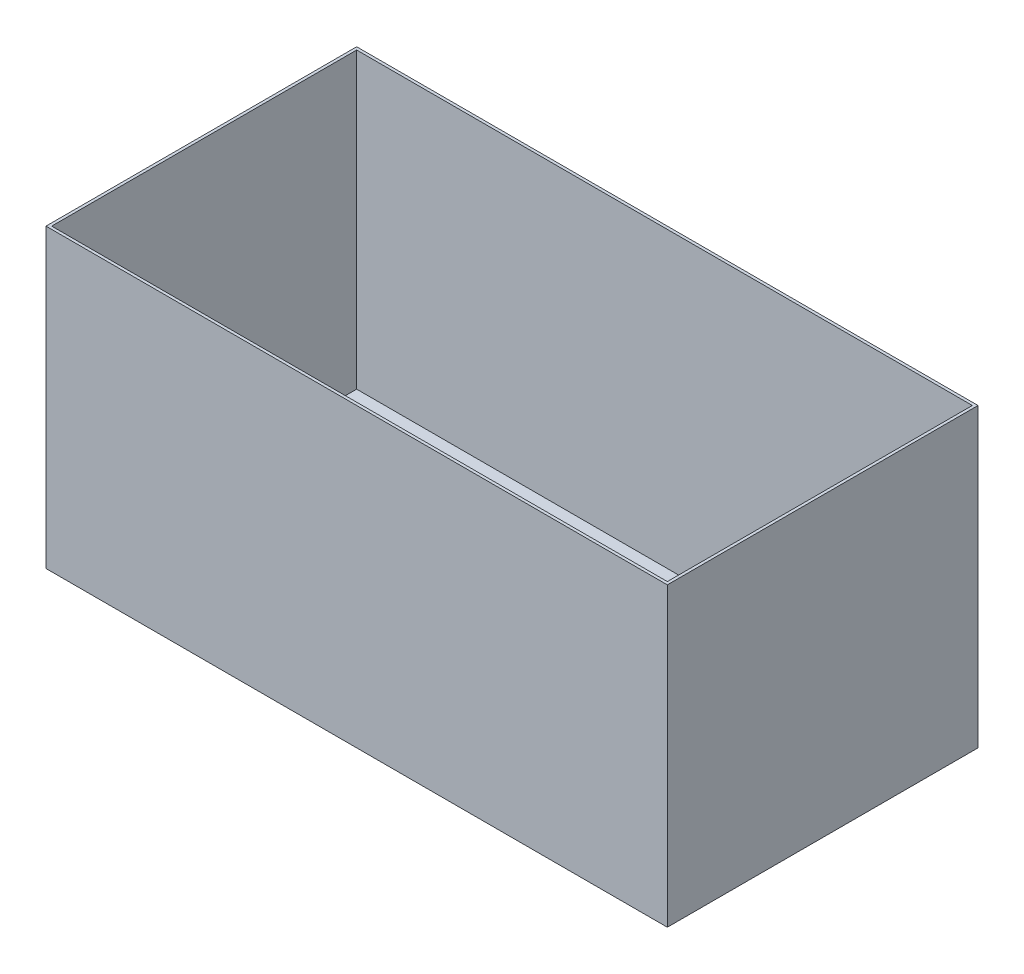
ISO-10303-21;
HEADER;
FILE_DESCRIPTION(('STEP AP214'),'2;1');
FILE_NAME('part.step','',(''),(''),'','','');
FILE_SCHEMA(('AUTOMOTIVE_DESIGN { 1 0 10303 214 1 1 1 1 }'));
ENDSEC;
DATA;
#1=APPLICATION_CONTEXT('core data for automotive mechanical design processes');
#2=APPLICATION_PROTOCOL_DEFINITION('international standard','automotive_design',2000,#1);
#3=PRODUCT_CONTEXT('',#1,'mechanical');
#4=PRODUCT('Part','Part','',(#3));
#5=PRODUCT_RELATED_PRODUCT_CATEGORY('part','',(#4));
#6=PRODUCT_DEFINITION_FORMATION('','',#4);
#7=PRODUCT_DEFINITION_CONTEXT('part definition',#1,'design');
#8=PRODUCT_DEFINITION('design','',#6,#7);
#9=PRODUCT_DEFINITION_SHAPE('','',#8);
#10=(LENGTH_UNIT() NAMED_UNIT(*) SI_UNIT(.MILLI.,.METRE.));
#11=(NAMED_UNIT(*) PLANE_ANGLE_UNIT() SI_UNIT($,.RADIAN.));
#12=(NAMED_UNIT(*) SI_UNIT($,.STERADIAN.) SOLID_ANGLE_UNIT());
#13=UNCERTAINTY_MEASURE_WITH_UNIT(LENGTH_MEASURE(1.E-05),#10,'distance_accuracy_value','');
#14=(GEOMETRIC_REPRESENTATION_CONTEXT(3) GLOBAL_UNCERTAINTY_ASSIGNED_CONTEXT((#13)) GLOBAL_UNIT_ASSIGNED_CONTEXT((#10,
#11,#12)) REPRESENTATION_CONTEXT('',''));
#15=CARTESIAN_POINT('',(0.,0.,0.));
#16=DIRECTION('',(0.,0.,1.));
#17=DIRECTION('',(1.,0.,0.));
#18=AXIS2_PLACEMENT_3D('',#15,#16,#17);
#19=CARTESIAN_POINT('',(0.,1050.,0.));
#20=DIRECTION('',(-1.,0.,0.));
#21=DIRECTION('',(0.,0.,1.));
#22=AXIS2_PLACEMENT_3D('',#19,#20,#21);
#23=PLANE('',#22);
#24=DIRECTION('',(0.,0.,-1.));
#25=VECTOR('',#24,1.);
#26=CARTESIAN_POINT('',(0.,0.,0.));
#27=LINE('',#26,#25);
#28=CARTESIAN_POINT('',(0.,0.,0.));
#29=VERTEX_POINT('',#28);
#30=CARTESIAN_POINT('',(0.,0.,-1100.));
#31=VERTEX_POINT('',#30);
#32=EDGE_CURVE('E153',#29,#31,#27,.T.);
#33=ORIENTED_EDGE('',*,*,#32,.T.);
#34=DIRECTION('',(0.,-1.,0.));
#35=VECTOR('',#34,1.);
#36=CARTESIAN_POINT('',(0.,1050.,-1100.));
#37=LINE('',#36,#35);
#38=CARTESIAN_POINT('',(0.,1050.,-1100.));
#39=VERTEX_POINT('',#38);
#40=EDGE_CURVE('E203',#39,#31,#37,.T.);
#41=ORIENTED_EDGE('',*,*,#40,.F.);
#42=DIRECTION('',(0.,0.,-1.));
#43=VECTOR('',#42,1.);
#44=CARTESIAN_POINT('',(0.,1050.,0.));
#45=LINE('',#44,#43);
#46=CARTESIAN_POINT('',(0.,1050.,0.));
#47=VERTEX_POINT('',#46);
#48=EDGE_CURVE('E185',#47,#39,#45,.T.);
#49=ORIENTED_EDGE('',*,*,#48,.F.);
#50=DIRECTION('',(0.,-1.,0.));
#51=VECTOR('',#50,1.);
#52=CARTESIAN_POINT('',(0.,1050.,0.));
#53=LINE('',#52,#51);
#54=EDGE_CURVE('E194',#47,#29,#53,.T.);
#55=ORIENTED_EDGE('',*,*,#54,.T.);
#56=EDGE_LOOP('',(#33,#41,#49,#55));
#57=FACE_BOUND('',#56,.T.);
#58=ADVANCED_FACE('F31',(#57),#23,.F.);
#59=CARTESIAN_POINT('',(0.,1050.,-1100.));
#60=DIRECTION('',(0.,0.,1.));
#61=DIRECTION('',(1.,0.,0.));
#62=AXIS2_PLACEMENT_3D('',#59,#60,#61);
#63=PLANE('',#62);
#64=DIRECTION('',(-1.,0.,0.));
#65=VECTOR('',#64,1.);
#66=CARTESIAN_POINT('',(0.,0.,-1100.));
#67=LINE('',#66,#65);
#68=CARTESIAN_POINT('',(-2200.,0.,-1100.));
#69=VERTEX_POINT('',#68);
#70=EDGE_CURVE('E179',#31,#69,#67,.T.);
#71=ORIENTED_EDGE('',*,*,#70,.T.);
#72=DIRECTION('',(0.,-1.,0.));
#73=VECTOR('',#72,1.);
#74=CARTESIAN_POINT('',(-2200.,1050.,-1100.));
#75=LINE('',#74,#73);
#76=CARTESIAN_POINT('',(-2200.,1050.,-1100.));
#77=VERTEX_POINT('',#76);
#78=EDGE_CURVE('E200',#77,#69,#75,.T.);
#79=ORIENTED_EDGE('',*,*,#78,.F.);
#80=DIRECTION('',(-1.,0.,0.));
#81=VECTOR('',#80,1.);
#82=CARTESIAN_POINT('',(0.,1050.,-1100.));
#83=LINE('',#82,#81);
#84=EDGE_CURVE('E188',#39,#77,#83,.T.);
#85=ORIENTED_EDGE('',*,*,#84,.F.);
#86=ORIENTED_EDGE('',*,*,#40,.T.);
#87=EDGE_LOOP('',(#71,#79,#85,#86));
#88=FACE_BOUND('',#87,.T.);
#89=ADVANCED_FACE('F229',(#88),#63,.F.);
#90=CARTESIAN_POINT('',(-2200.,1050.,2.69413397840923E-13));
#91=DIRECTION('',(1.,0.,0.));
#92=DIRECTION('',(0.,0.,-1.));
#93=AXIS2_PLACEMENT_3D('',#90,#91,#92);
#94=PLANE('',#93);
#95=DIRECTION('',(0.,0.,1.));
#96=VECTOR('',#95,1.);
#97=CARTESIAN_POINT('',(-2200.,0.,2.69413397840923E-13));
#98=LINE('',#97,#96);
#99=CARTESIAN_POINT('',(-2200.,0.,2.69413397840923E-13));
#100=VERTEX_POINT('',#99);
#101=EDGE_CURVE('E181',#69,#100,#98,.T.);
#102=ORIENTED_EDGE('',*,*,#101,.T.);
#103=DIRECTION('',(0.,-1.,0.));
#104=VECTOR('',#103,1.);
#105=CARTESIAN_POINT('',(-2200.,1050.,2.69413397840923E-13));
#106=LINE('',#105,#104);
#107=CARTESIAN_POINT('',(-2200.,1050.,2.69413397840923E-13));
#108=VERTEX_POINT('',#107);
#109=EDGE_CURVE('E197',#108,#100,#106,.T.);
#110=ORIENTED_EDGE('',*,*,#109,.F.);
#111=DIRECTION('',(0.,0.,1.));
#112=VECTOR('',#111,1.);
#113=CARTESIAN_POINT('',(-2200.,1050.,2.69413397840923E-13));
#114=LINE('',#113,#112);
#115=EDGE_CURVE('E190',#77,#108,#114,.T.);
#116=ORIENTED_EDGE('',*,*,#115,.F.);
#117=ORIENTED_EDGE('',*,*,#78,.T.);
#118=EDGE_LOOP('',(#102,#110,#116,#117));
#119=FACE_BOUND('',#118,.T.);
#120=ADVANCED_FACE('F234',(#119),#94,.F.);
#121=CARTESIAN_POINT('',(0.,1050.,0.));
#122=DIRECTION('',(0.,0.,-1.));
#123=DIRECTION('',(-1.,0.,0.));
#124=AXIS2_PLACEMENT_3D('',#121,#122,#123);
#125=PLANE('',#124);
#126=DIRECTION('',(1.,0.,0.));
#127=VECTOR('',#126,1.);
#128=CARTESIAN_POINT('',(0.,0.,0.));
#129=LINE('',#128,#127);
#130=EDGE_CURVE('E183',#100,#29,#129,.T.);
#131=ORIENTED_EDGE('',*,*,#130,.T.);
#132=ORIENTED_EDGE('',*,*,#54,.F.);
#133=DIRECTION('',(1.,0.,0.));
#134=VECTOR('',#133,1.);
#135=CARTESIAN_POINT('',(0.,1050.,0.));
#136=LINE('',#135,#134);
#137=EDGE_CURVE('E192',#108,#47,#136,.T.);
#138=ORIENTED_EDGE('',*,*,#137,.F.);
#139=ORIENTED_EDGE('',*,*,#109,.T.);
#140=EDGE_LOOP('',(#131,#132,#138,#139));
#141=FACE_BOUND('',#140,.T.);
#142=ADVANCED_FACE('F249',(#141),#125,.F.);
#143=CARTESIAN_POINT('',(0.,1050.,-1100.));
#144=DIRECTION('',(0.,1.,0.));
#145=DIRECTION('',(0.,0.,1.));
#146=AXIS2_PLACEMENT_3D('',#143,#144,#145);
#147=PLANE('',#146);
#148=DIRECTION('',(0.,0.,-1.));
#149=VECTOR('',#148,1.);
#150=CARTESIAN_POINT('',(-10.,1050.,0.));
#151=LINE('',#150,#149);
#152=CARTESIAN_POINT('',(-10.,1050.,-10.));
#153=VERTEX_POINT('',#152);
#154=CARTESIAN_POINT('',(-10.,1050.,-1090.));
#155=VERTEX_POINT('',#154);
#156=EDGE_CURVE('E169',#153,#155,#151,.T.);
#157=ORIENTED_EDGE('',*,*,#156,.F.);
#158=DIRECTION('',(1.,0.,0.));
#159=VECTOR('',#158,1.);
#160=CARTESIAN_POINT('',(0.,1050.,-10.));
#161=LINE('',#160,#159);
#162=CARTESIAN_POINT('',(-2190.,1050.,-9.99999999999973));
#163=VERTEX_POINT('',#162);
#164=EDGE_CURVE('E159',#163,#153,#161,.T.);
#165=ORIENTED_EDGE('',*,*,#164,.F.);
#166=DIRECTION('',(0.,0.,1.));
#167=VECTOR('',#166,1.);
#168=CARTESIAN_POINT('',(-2190.,1050.,2.69413397840923E-13));
#169=LINE('',#168,#167);
#170=CARTESIAN_POINT('',(-2190.,1050.,-1090.));
#171=VERTEX_POINT('',#170);
#172=EDGE_CURVE('E173',#171,#163,#169,.T.);
#173=ORIENTED_EDGE('',*,*,#172,.F.);
#174=DIRECTION('',(-1.,0.,0.));
#175=VECTOR('',#174,1.);
#176=CARTESIAN_POINT('',(0.,1050.,-1090.));
#177=LINE('',#176,#175);
#178=EDGE_CURVE('E171',#155,#171,#177,.T.);
#179=ORIENTED_EDGE('',*,*,#178,.F.);
#180=EDGE_LOOP('',(#157,#165,#173,#179));
#181=FACE_BOUND('',#180,.T.);
#182=ORIENTED_EDGE('',*,*,#48,.T.);
#183=ORIENTED_EDGE('',*,*,#84,.T.);
#184=ORIENTED_EDGE('',*,*,#115,.T.);
#185=ORIENTED_EDGE('',*,*,#137,.T.);
#186=EDGE_LOOP('',(#182,#183,#184,#185));
#187=FACE_BOUND('',#186,.T.);
#188=ADVANCED_FACE('F245',(#181,#187),#147,.T.);
#189=CARTESIAN_POINT('',(0.,0.,-1100.));
#190=DIRECTION('',(0.,1.,0.));
#191=DIRECTION('',(0.,0.,1.));
#192=AXIS2_PLACEMENT_3D('',#189,#190,#191);
#193=PLANE('',#192);
#194=DIRECTION('',(-1.,0.,0.));
#195=VECTOR('',#194,1.);
#196=CARTESIAN_POINT('',(-100.,0.,-250.));
#197=LINE('',#196,#195);
#198=CARTESIAN_POINT('',(-100.,0.,-250.));
#199=VERTEX_POINT('',#198);
#200=CARTESIAN_POINT('',(-700.,0.,-250.));
#201=VERTEX_POINT('',#200);
#202=EDGE_CURVE('E130',#199,#201,#197,.T.);
#203=ORIENTED_EDGE('',*,*,#202,.F.);
#204=DIRECTION('',(0.,0.,1.));
#205=VECTOR('',#204,1.);
#206=CARTESIAN_POINT('',(-100.,0.,-250.));
#207=LINE('',#206,#205);
#208=CARTESIAN_POINT('',(-99.9999999999999,0.,-850.));
#209=VERTEX_POINT('',#208);
#210=EDGE_CURVE('E45',#209,#199,#207,.T.);
#211=ORIENTED_EDGE('',*,*,#210,.F.);
#212=DIRECTION('',(1.,0.,0.));
#213=VECTOR('',#212,1.);
#214=CARTESIAN_POINT('',(-99.9999999999999,0.,-850.));
#215=LINE('',#214,#213);
#216=CARTESIAN_POINT('',(-700.,0.,-850.));
#217=VERTEX_POINT('',#216);
#218=EDGE_CURVE('E137',#217,#209,#215,.T.);
#219=ORIENTED_EDGE('',*,*,#218,.F.);
#220=DIRECTION('',(0.,0.,-1.));
#221=VECTOR('',#220,1.);
#222=CARTESIAN_POINT('',(-700.,0.,-250.));
#223=LINE('',#222,#221);
#224=EDGE_CURVE('E121',#201,#217,#223,.T.);
#225=ORIENTED_EDGE('',*,*,#224,.F.);
#226=EDGE_LOOP('',(#203,#211,#219,#225));
#227=FACE_BOUND('',#226,.T.);
#228=ORIENTED_EDGE('',*,*,#32,.F.);
#229=ORIENTED_EDGE('',*,*,#130,.F.);
#230=ORIENTED_EDGE('',*,*,#101,.F.);
#231=ORIENTED_EDGE('',*,*,#70,.F.);
#232=EDGE_LOOP('',(#228,#229,#230,#231));
#233=FACE_BOUND('',#232,.T.);
#234=ADVANCED_FACE('F134',(#227,#233),#193,.F.);
#235=CARTESIAN_POINT('',(-10.,1050.,0.));
#236=DIRECTION('',(-1.,0.,0.));
#237=DIRECTION('',(0.,0.,1.));
#238=AXIS2_PLACEMENT_3D('',#235,#236,#237);
#239=PLANE('',#238);
#240=DIRECTION('',(0.,0.,-1.));
#241=VECTOR('',#240,1.);
#242=CARTESIAN_POINT('',(-10.,10.,0.));
#243=LINE('',#242,#241);
#244=CARTESIAN_POINT('',(-10.,10.,-10.));
#245=VERTEX_POINT('',#244);
#246=CARTESIAN_POINT('',(-10.,10.,-1090.));
#247=VERTEX_POINT('',#246);
#248=EDGE_CURVE('E144',#245,#247,#243,.T.);
#249=ORIENTED_EDGE('',*,*,#248,.F.);
#250=DIRECTION('',(0.,-1.,0.));
#251=VECTOR('',#250,1.);
#252=CARTESIAN_POINT('',(-10.,1050.,-10.));
#253=LINE('',#252,#251);
#254=EDGE_CURVE('E155',#153,#245,#253,.T.);
#255=ORIENTED_EDGE('',*,*,#254,.F.);
#256=ORIENTED_EDGE('',*,*,#156,.T.);
#257=DIRECTION('',(0.,-1.,0.));
#258=VECTOR('',#257,1.);
#259=CARTESIAN_POINT('',(-10.,1050.,-1090.));
#260=LINE('',#259,#258);
#261=EDGE_CURVE('E150',#155,#247,#260,.T.);
#262=ORIENTED_EDGE('',*,*,#261,.T.);
#263=EDGE_LOOP('',(#249,#255,#256,#262));
#264=FACE_BOUND('',#263,.T.);
#265=ADVANCED_FACE('F262',(#264),#239,.T.);
#266=CARTESIAN_POINT('',(0.,1050.,-1090.));
#267=DIRECTION('',(0.,0.,1.));
#268=DIRECTION('',(1.,0.,0.));
#269=AXIS2_PLACEMENT_3D('',#266,#267,#268);
#270=PLANE('',#269);
#271=DIRECTION('',(-1.,0.,0.));
#272=VECTOR('',#271,1.);
#273=CARTESIAN_POINT('',(0.,10.,-1090.));
#274=LINE('',#273,#272);
#275=CARTESIAN_POINT('',(-2190.,10.,-1090.));
#276=VERTEX_POINT('',#275);
#277=EDGE_CURVE('E149',#247,#276,#274,.T.);
#278=ORIENTED_EDGE('',*,*,#277,.F.);
#279=ORIENTED_EDGE('',*,*,#261,.F.);
#280=ORIENTED_EDGE('',*,*,#178,.T.);
#281=DIRECTION('',(0.,-1.,0.));
#282=VECTOR('',#281,1.);
#283=CARTESIAN_POINT('',(-2190.,1050.,-1090.));
#284=LINE('',#283,#282);
#285=EDGE_CURVE('E154',#171,#276,#284,.T.);
#286=ORIENTED_EDGE('',*,*,#285,.T.);
#287=EDGE_LOOP('',(#278,#279,#280,#286));
#288=FACE_BOUND('',#287,.T.);
#289=ADVANCED_FACE('F270',(#288),#270,.T.);
#290=CARTESIAN_POINT('',(-2190.,1050.,2.69413397840923E-13));
#291=DIRECTION('',(1.,0.,0.));
#292=DIRECTION('',(0.,0.,-1.));
#293=AXIS2_PLACEMENT_3D('',#290,#291,#292);
#294=PLANE('',#293);
#295=DIRECTION('',(0.,0.,1.));
#296=VECTOR('',#295,1.);
#297=CARTESIAN_POINT('',(-2190.,10.,2.69413397840923E-13));
#298=LINE('',#297,#296);
#299=CARTESIAN_POINT('',(-2190.,10.,-9.99999999999973));
#300=VERTEX_POINT('',#299);
#301=EDGE_CURVE('E161',#276,#300,#298,.T.);
#302=ORIENTED_EDGE('',*,*,#301,.F.);
#303=ORIENTED_EDGE('',*,*,#285,.F.);
#304=ORIENTED_EDGE('',*,*,#172,.T.);
#305=DIRECTION('',(0.,-1.,0.));
#306=VECTOR('',#305,1.);
#307=CARTESIAN_POINT('',(-2190.,1050.,-9.99999999999973));
#308=LINE('',#307,#306);
#309=EDGE_CURVE('E158',#163,#300,#308,.T.);
#310=ORIENTED_EDGE('',*,*,#309,.T.);
#311=EDGE_LOOP('',(#302,#303,#304,#310));
#312=FACE_BOUND('',#311,.T.);
#313=ADVANCED_FACE('F266',(#312),#294,.T.);
#314=CARTESIAN_POINT('',(0.,1050.,-10.));
#315=DIRECTION('',(0.,0.,-1.));
#316=DIRECTION('',(-1.,0.,0.));
#317=AXIS2_PLACEMENT_3D('',#314,#315,#316);
#318=PLANE('',#317);
#319=DIRECTION('',(1.,0.,0.));
#320=VECTOR('',#319,1.);
#321=CARTESIAN_POINT('',(0.,10.,-10.));
#322=LINE('',#321,#320);
#323=EDGE_CURVE('E165',#300,#245,#322,.T.);
#324=ORIENTED_EDGE('',*,*,#323,.F.);
#325=ORIENTED_EDGE('',*,*,#309,.F.);
#326=ORIENTED_EDGE('',*,*,#164,.T.);
#327=ORIENTED_EDGE('',*,*,#254,.T.);
#328=EDGE_LOOP('',(#324,#325,#326,#327));
#329=FACE_BOUND('',#328,.T.);
#330=ADVANCED_FACE('F224',(#329),#318,.T.);
#331=CARTESIAN_POINT('',(0.,10.,-1100.));
#332=DIRECTION('',(0.,1.,0.));
#333=DIRECTION('',(0.,0.,1.));
#334=AXIS2_PLACEMENT_3D('',#331,#332,#333);
#335=PLANE('',#334);
#336=DIRECTION('',(0.,0.,-1.));
#337=VECTOR('',#336,1.);
#338=CARTESIAN_POINT('',(-99.9999999999999,10.,-1100.));
#339=LINE('',#338,#337);
#340=CARTESIAN_POINT('',(-100.,10.,-250.));
#341=VERTEX_POINT('',#340);
#342=CARTESIAN_POINT('',(-99.9999999999999,10.,-850.));
#343=VERTEX_POINT('',#342);
#344=EDGE_CURVE('E11',#341,#343,#339,.T.);
#345=ORIENTED_EDGE('',*,*,#344,.F.);
#346=DIRECTION('',(1.,0.,0.));
#347=VECTOR('',#346,1.);
#348=CARTESIAN_POINT('',(0.,10.,-250.));
#349=LINE('',#348,#347);
#350=CARTESIAN_POINT('',(-700.,10.,-250.));
#351=VERTEX_POINT('',#350);
#352=EDGE_CURVE('E206',#351,#341,#349,.T.);
#353=ORIENTED_EDGE('',*,*,#352,.F.);
#354=DIRECTION('',(0.,0.,1.));
#355=VECTOR('',#354,1.);
#356=CARTESIAN_POINT('',(-700.,10.,-1100.));
#357=LINE('',#356,#355);
#358=CARTESIAN_POINT('',(-700.,10.,-850.));
#359=VERTEX_POINT('',#358);
#360=EDGE_CURVE('E124',#359,#351,#357,.T.);
#361=ORIENTED_EDGE('',*,*,#360,.F.);
#362=DIRECTION('',(-1.,0.,0.));
#363=VECTOR('',#362,1.);
#364=CARTESIAN_POINT('',(0.,10.,-850.));
#365=LINE('',#364,#363);
#366=EDGE_CURVE('E38',#343,#359,#365,.T.);
#367=ORIENTED_EDGE('',*,*,#366,.F.);
#368=EDGE_LOOP('',(#345,#353,#361,#367));
#369=FACE_BOUND('',#368,.T.);
#370=ORIENTED_EDGE('',*,*,#248,.T.);
#371=ORIENTED_EDGE('',*,*,#277,.T.);
#372=ORIENTED_EDGE('',*,*,#301,.T.);
#373=ORIENTED_EDGE('',*,*,#323,.T.);
#374=EDGE_LOOP('',(#370,#371,#372,#373));
#375=FACE_BOUND('',#374,.T.);
#376=ADVANCED_FACE('F214',(#369,#375),#335,.T.);
#377=CARTESIAN_POINT('',(-100.,400.,-250.));
#378=DIRECTION('',(1.,0.,0.));
#379=DIRECTION('',(0.,0.,-1.));
#380=AXIS2_PLACEMENT_3D('',#377,#378,#379);
#381=PLANE('',#380);
#382=ORIENTED_EDGE('',*,*,#344,.T.);
#383=DIRECTION('',(0.,-1.,0.));
#384=VECTOR('',#383,1.);
#385=CARTESIAN_POINT('',(-99.9999999999999,400.,-850.));
#386=LINE('',#385,#384);
#387=EDGE_CURVE('E142',#343,#209,#386,.T.);
#388=ORIENTED_EDGE('',*,*,#387,.T.);
#389=ORIENTED_EDGE('',*,*,#210,.T.);
#390=DIRECTION('',(0.,-1.,0.));
#391=VECTOR('',#390,1.);
#392=CARTESIAN_POINT('',(-100.,400.,-250.));
#393=LINE('',#392,#391);
#394=EDGE_CURVE('E127',#341,#199,#393,.T.);
#395=ORIENTED_EDGE('',*,*,#394,.F.);
#396=EDGE_LOOP('',(#382,#388,#389,#395));
#397=FACE_BOUND('',#396,.T.);
#398=ADVANCED_FACE('F216',(#397),#381,.F.);
#399=CARTESIAN_POINT('',(-99.9999999999999,400.,-850.));
#400=DIRECTION('',(0.,0.,-1.));
#401=DIRECTION('',(-1.,0.,0.));
#402=AXIS2_PLACEMENT_3D('',#399,#400,#401);
#403=PLANE('',#402);
#404=ORIENTED_EDGE('',*,*,#366,.T.);
#405=DIRECTION('',(0.,-1.,0.));
#406=VECTOR('',#405,1.);
#407=CARTESIAN_POINT('',(-700.,400.,-850.));
#408=LINE('',#407,#406);
#409=EDGE_CURVE('E126',#359,#217,#408,.T.);
#410=ORIENTED_EDGE('',*,*,#409,.T.);
#411=ORIENTED_EDGE('',*,*,#218,.T.);
#412=ORIENTED_EDGE('',*,*,#387,.F.);
#413=EDGE_LOOP('',(#404,#410,#411,#412));
#414=FACE_BOUND('',#413,.T.);
#415=ADVANCED_FACE('F211',(#414),#403,.F.);
#416=CARTESIAN_POINT('',(-700.,400.,-250.));
#417=DIRECTION('',(-1.,0.,0.));
#418=DIRECTION('',(0.,0.,1.));
#419=AXIS2_PLACEMENT_3D('',#416,#417,#418);
#420=PLANE('',#419);
#421=ORIENTED_EDGE('',*,*,#360,.T.);
#422=DIRECTION('',(0.,-1.,0.));
#423=VECTOR('',#422,1.);
#424=CARTESIAN_POINT('',(-700.,400.,-250.));
#425=LINE('',#424,#423);
#426=EDGE_CURVE('E53',#351,#201,#425,.T.);
#427=ORIENTED_EDGE('',*,*,#426,.T.);
#428=ORIENTED_EDGE('',*,*,#224,.T.);
#429=ORIENTED_EDGE('',*,*,#409,.F.);
#430=EDGE_LOOP('',(#421,#427,#428,#429));
#431=FACE_BOUND('',#430,.T.);
#432=ADVANCED_FACE('F118',(#431),#420,.F.);
#433=CARTESIAN_POINT('',(-100.,400.,-250.));
#434=DIRECTION('',(0.,0.,1.));
#435=DIRECTION('',(1.,0.,0.));
#436=AXIS2_PLACEMENT_3D('',#433,#434,#435);
#437=PLANE('',#436);
#438=ORIENTED_EDGE('',*,*,#352,.T.);
#439=ORIENTED_EDGE('',*,*,#394,.T.);
#440=ORIENTED_EDGE('',*,*,#202,.T.);
#441=ORIENTED_EDGE('',*,*,#426,.F.);
#442=EDGE_LOOP('',(#438,#439,#440,#441));
#443=FACE_BOUND('',#442,.T.);
#444=ADVANCED_FACE('F131',(#443),#437,.F.);
#445=CLOSED_SHELL('',(#58,#89,#120,#142,#188,#234,#265,#289,#313,#330,#376,#398,#415,#432,#444));
#446=MANIFOLD_SOLID_BREP('B2',#445);
#447=ADVANCED_BREP_SHAPE_REPRESENTATION('',(#18,#446),#14);
#448=SHAPE_DEFINITION_REPRESENTATION(#9,#447);
ENDSEC;
END-ISO-10303-21;
